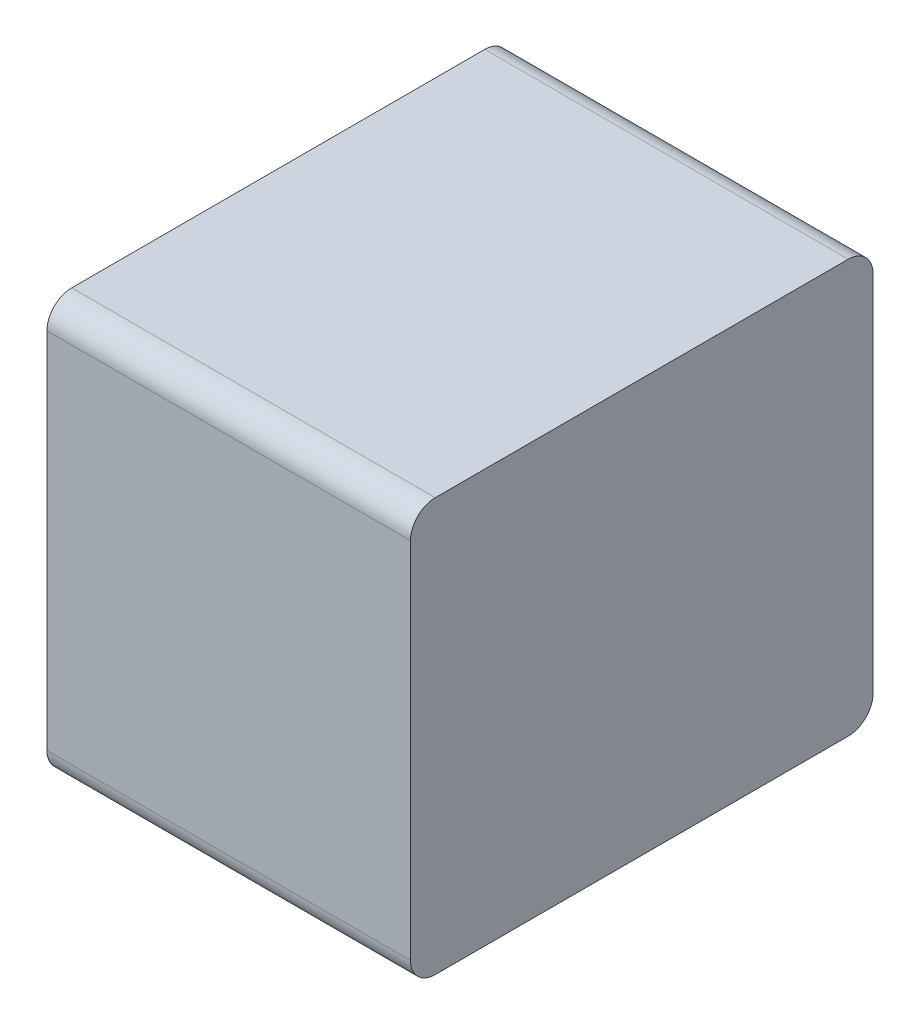
ISO-10303-21;
HEADER;
FILE_DESCRIPTION(('STEP AP214'),'2;1');
FILE_NAME('part.step','',(''),(''),'','','');
FILE_SCHEMA(('AUTOMOTIVE_DESIGN { 1 0 10303 214 1 1 1 1 }'));
ENDSEC;
DATA;
#1=APPLICATION_CONTEXT('core data for automotive mechanical design processes');
#2=APPLICATION_PROTOCOL_DEFINITION('international standard','automotive_design',2000,#1);
#3=PRODUCT_CONTEXT('',#1,'mechanical');
#4=PRODUCT('Part','Part','',(#3));
#5=PRODUCT_RELATED_PRODUCT_CATEGORY('part','',(#4));
#6=PRODUCT_DEFINITION_FORMATION('','',#4);
#7=PRODUCT_DEFINITION_CONTEXT('part definition',#1,'design');
#8=PRODUCT_DEFINITION('design','',#6,#7);
#9=PRODUCT_DEFINITION_SHAPE('','',#8);
#10=(LENGTH_UNIT() NAMED_UNIT(*) SI_UNIT(.MILLI.,.METRE.));
#11=(NAMED_UNIT(*) PLANE_ANGLE_UNIT() SI_UNIT($,.RADIAN.));
#12=(NAMED_UNIT(*) SI_UNIT($,.STERADIAN.) SOLID_ANGLE_UNIT());
#13=UNCERTAINTY_MEASURE_WITH_UNIT(LENGTH_MEASURE(1.E-05),#10,'distance_accuracy_value','');
#14=(GEOMETRIC_REPRESENTATION_CONTEXT(3) GLOBAL_UNCERTAINTY_ASSIGNED_CONTEXT((#13)) GLOBAL_UNIT_ASSIGNED_CONTEXT((#10,
#11,#12)) REPRESENTATION_CONTEXT('',''));
#15=CARTESIAN_POINT('',(0.,0.,0.));
#16=DIRECTION('',(0.,0.,1.));
#17=DIRECTION('',(1.,0.,0.));
#18=AXIS2_PLACEMENT_3D('',#15,#16,#17);
#19=CARTESIAN_POINT('',(0.55,1.1,0.15));
#20=DIRECTION('',(1.,0.,0.));
#21=DIRECTION('',(0.,0.707106781186547,-0.707106781186548));
#22=AXIS2_PLACEMENT_3D('',#19,#20,#21);
#23=CYLINDRICAL_SURFACE('',#22,0.15);
#24=CARTESIAN_POINT('',(1.1,1.1,0.15));
#25=DIRECTION('',(-1.,0.,0.));
#26=DIRECTION('',(0.,1.,0.));
#27=AXIS2_PLACEMENT_3D('',#24,#25,#26);
#28=CIRCLE('',#27,0.15);
#29=CARTESIAN_POINT('',(1.1,1.25,0.15));
#30=VERTEX_POINT('',#29);
#31=CARTESIAN_POINT('',(1.1,1.1,0.));
#32=VERTEX_POINT('',#31);
#33=EDGE_CURVE('E11',#30,#32,#28,.T.);
#34=ORIENTED_EDGE('',*,*,#33,.T.);
#35=DIRECTION('',(-1.,0.,0.));
#36=VECTOR('',#35,1.);
#37=CARTESIAN_POINT('',(1.1,1.1,0.));
#38=LINE('',#37,#36);
#39=CARTESIAN_POINT('',(-1.1,1.1,0.));
#40=VERTEX_POINT('',#39);
#41=EDGE_CURVE('E144',#32,#40,#38,.T.);
#42=ORIENTED_EDGE('',*,*,#41,.T.);
#43=CARTESIAN_POINT('',(-1.1,1.1,0.15));
#44=DIRECTION('',(1.,0.,0.));
#45=DIRECTION('',(0.,0.,-1.));
#46=AXIS2_PLACEMENT_3D('',#43,#44,#45);
#47=CIRCLE('',#46,0.15);
#48=CARTESIAN_POINT('',(-1.1,1.25,0.15));
#49=VERTEX_POINT('',#48);
#50=EDGE_CURVE('E142',#40,#49,#47,.T.);
#51=ORIENTED_EDGE('',*,*,#50,.T.);
#52=DIRECTION('',(1.,0.,0.));
#53=VECTOR('',#52,1.);
#54=CARTESIAN_POINT('',(-1.1,1.25,0.15));
#55=LINE('',#54,#53);
#56=EDGE_CURVE('E24',#49,#30,#55,.T.);
#57=ORIENTED_EDGE('',*,*,#56,.T.);
#58=EDGE_LOOP('',(#34,#42,#51,#57));
#59=FACE_BOUND('',#58,.T.);
#60=ADVANCED_FACE('F17',(#59),#23,.T.);
#61=CARTESIAN_POINT('',(1.1,1.25,0.));
#62=DIRECTION('',(0.,1.,0.));
#63=DIRECTION('',(-1.,0.,0.));
#64=AXIS2_PLACEMENT_3D('',#61,#62,#63);
#65=PLANE('',#64);
#66=ORIENTED_EDGE('',*,*,#56,.F.);
#67=DIRECTION('',(0.,0.,1.));
#68=VECTOR('',#67,1.);
#69=CARTESIAN_POINT('',(-1.1,1.25,0.15));
#70=LINE('',#69,#68);
#71=CARTESIAN_POINT('',(-1.1,1.25,2.65));
#72=VERTEX_POINT('',#71);
#73=EDGE_CURVE('E140',#49,#72,#70,.T.);
#74=ORIENTED_EDGE('',*,*,#73,.T.);
#75=DIRECTION('',(-1.,0.,0.));
#76=VECTOR('',#75,1.);
#77=CARTESIAN_POINT('',(1.1,1.25,2.65));
#78=LINE('',#77,#76);
#79=CARTESIAN_POINT('',(1.1,1.25,2.65));
#80=VERTEX_POINT('',#79);
#81=EDGE_CURVE('E132',#80,#72,#78,.T.);
#82=ORIENTED_EDGE('',*,*,#81,.F.);
#83=DIRECTION('',(0.,0.,1.));
#84=VECTOR('',#83,1.);
#85=CARTESIAN_POINT('',(1.1,1.25,0.15));
#86=LINE('',#85,#84);
#87=EDGE_CURVE('E125',#30,#80,#86,.T.);
#88=ORIENTED_EDGE('',*,*,#87,.F.);
#89=EDGE_LOOP('',(#66,#74,#82,#88));
#90=FACE_BOUND('',#89,.T.);
#91=ADVANCED_FACE('F147',(#90),#65,.T.);
#92=CARTESIAN_POINT('',(-1.1,1.25,0.));
#93=DIRECTION('',(-1.,0.,0.));
#94=DIRECTION('',(0.,-1.,0.));
#95=AXIS2_PLACEMENT_3D('',#92,#93,#94);
#96=PLANE('',#95);
#97=ORIENTED_EDGE('',*,*,#50,.F.);
#98=DIRECTION('',(0.,1.,0.));
#99=VECTOR('',#98,1.);
#100=CARTESIAN_POINT('',(-1.1,-1.1,0.));
#101=LINE('',#100,#99);
#102=CARTESIAN_POINT('',(-1.1,-1.1,0.));
#103=VERTEX_POINT('',#102);
#104=EDGE_CURVE('E135',#103,#40,#101,.T.);
#105=ORIENTED_EDGE('',*,*,#104,.F.);
#106=CARTESIAN_POINT('',(-1.1,-1.1,0.15));
#107=DIRECTION('',(1.,0.,0.));
#108=DIRECTION('',(0.,-1.,0.));
#109=AXIS2_PLACEMENT_3D('',#106,#107,#108);
#110=CIRCLE('',#109,0.15);
#111=CARTESIAN_POINT('',(-1.1,-1.25,0.15));
#112=VERTEX_POINT('',#111);
#113=EDGE_CURVE('E138',#112,#103,#110,.T.);
#114=ORIENTED_EDGE('',*,*,#113,.F.);
#115=DIRECTION('',(0.,0.,1.));
#116=VECTOR('',#115,1.);
#117=CARTESIAN_POINT('',(-1.1,-1.25,0.15));
#118=LINE('',#117,#116);
#119=CARTESIAN_POINT('',(-1.1,-1.25,2.65));
#120=VERTEX_POINT('',#119);
#121=EDGE_CURVE('E118',#112,#120,#118,.T.);
#122=ORIENTED_EDGE('',*,*,#121,.T.);
#123=CARTESIAN_POINT('',(-1.1,-1.1,2.65));
#124=DIRECTION('',(1.,0.,0.));
#125=DIRECTION('',(0.,0.,1.));
#126=AXIS2_PLACEMENT_3D('',#123,#124,#125);
#127=CIRCLE('',#126,0.15);
#128=CARTESIAN_POINT('',(-1.1,-1.1,2.8));
#129=VERTEX_POINT('',#128);
#130=EDGE_CURVE('E113',#129,#120,#127,.T.);
#131=ORIENTED_EDGE('',*,*,#130,.F.);
#132=DIRECTION('',(0.,-1.,0.));
#133=VECTOR('',#132,1.);
#134=CARTESIAN_POINT('',(-1.1,1.1,2.8));
#135=LINE('',#134,#133);
#136=CARTESIAN_POINT('',(-1.1,1.1,2.8));
#137=VERTEX_POINT('',#136);
#138=EDGE_CURVE('E89',#137,#129,#135,.T.);
#139=ORIENTED_EDGE('',*,*,#138,.F.);
#140=CARTESIAN_POINT('',(-1.1,1.1,2.65));
#141=DIRECTION('',(1.,0.,0.));
#142=DIRECTION('',(0.,1.,0.));
#143=AXIS2_PLACEMENT_3D('',#140,#141,#142);
#144=CIRCLE('',#143,0.15);
#145=EDGE_CURVE('E116',#72,#137,#144,.T.);
#146=ORIENTED_EDGE('',*,*,#145,.F.);
#147=ORIENTED_EDGE('',*,*,#73,.F.);
#148=EDGE_LOOP('',(#97,#105,#114,#122,#131,#139,#146,#147));
#149=FACE_BOUND('',#148,.T.);
#150=ADVANCED_FACE('F155',(#149),#96,.T.);
#151=CARTESIAN_POINT('',(-0.55,-1.1,0.15));
#152=DIRECTION('',(-1.,0.,0.));
#153=DIRECTION('',(0.,-0.707106781186548,-0.707106781186547));
#154=AXIS2_PLACEMENT_3D('',#151,#152,#153);
#155=CYLINDRICAL_SURFACE('',#154,0.15);
#156=ORIENTED_EDGE('',*,*,#113,.T.);
#157=DIRECTION('',(1.,0.,0.));
#158=VECTOR('',#157,1.);
#159=CARTESIAN_POINT('',(-1.1,-1.1,0.));
#160=LINE('',#159,#158);
#161=CARTESIAN_POINT('',(1.1,-1.1,0.));
#162=VERTEX_POINT('',#161);
#163=EDGE_CURVE('E127',#103,#162,#160,.T.);
#164=ORIENTED_EDGE('',*,*,#163,.T.);
#165=CARTESIAN_POINT('',(1.1,-1.1,0.15));
#166=DIRECTION('',(-1.,0.,0.));
#167=DIRECTION('',(0.,0.,-1.));
#168=AXIS2_PLACEMENT_3D('',#165,#166,#167);
#169=CIRCLE('',#168,0.15);
#170=CARTESIAN_POINT('',(1.1,-1.25,0.15));
#171=VERTEX_POINT('',#170);
#172=EDGE_CURVE('E120',#162,#171,#169,.T.);
#173=ORIENTED_EDGE('',*,*,#172,.T.);
#174=DIRECTION('',(-1.,0.,0.));
#175=VECTOR('',#174,1.);
#176=CARTESIAN_POINT('',(1.1,-1.25,0.15));
#177=LINE('',#176,#175);
#178=EDGE_CURVE('E129',#171,#112,#177,.T.);
#179=ORIENTED_EDGE('',*,*,#178,.T.);
#180=EDGE_LOOP('',(#156,#164,#173,#179));
#181=FACE_BOUND('',#180,.T.);
#182=ADVANCED_FACE('F177',(#181),#155,.T.);
#183=CARTESIAN_POINT('',(-1.1,-1.25,0.));
#184=DIRECTION('',(0.,-1.,0.));
#185=DIRECTION('',(1.,0.,0.));
#186=AXIS2_PLACEMENT_3D('',#183,#184,#185);
#187=PLANE('',#186);
#188=ORIENTED_EDGE('',*,*,#178,.F.);
#189=DIRECTION('',(0.,0.,1.));
#190=VECTOR('',#189,1.);
#191=CARTESIAN_POINT('',(1.1,-1.25,0.15));
#192=LINE('',#191,#190);
#193=CARTESIAN_POINT('',(1.1,-1.25,2.65));
#194=VERTEX_POINT('',#193);
#195=EDGE_CURVE('E123',#171,#194,#192,.T.);
#196=ORIENTED_EDGE('',*,*,#195,.T.);
#197=DIRECTION('',(1.,0.,0.));
#198=VECTOR('',#197,1.);
#199=CARTESIAN_POINT('',(-1.1,-1.25,2.65));
#200=LINE('',#199,#198);
#201=EDGE_CURVE('E86',#120,#194,#200,.T.);
#202=ORIENTED_EDGE('',*,*,#201,.F.);
#203=ORIENTED_EDGE('',*,*,#121,.F.);
#204=EDGE_LOOP('',(#188,#196,#202,#203));
#205=FACE_BOUND('',#204,.T.);
#206=ADVANCED_FACE('F167',(#205),#187,.T.);
#207=CARTESIAN_POINT('',(1.1,-1.25,0.));
#208=DIRECTION('',(1.,0.,0.));
#209=DIRECTION('',(0.,1.,0.));
#210=AXIS2_PLACEMENT_3D('',#207,#208,#209);
#211=PLANE('',#210);
#212=ORIENTED_EDGE('',*,*,#33,.F.);
#213=ORIENTED_EDGE('',*,*,#87,.T.);
#214=CARTESIAN_POINT('',(1.1,1.1,2.65));
#215=DIRECTION('',(-1.,0.,0.));
#216=DIRECTION('',(0.,0.,1.));
#217=AXIS2_PLACEMENT_3D('',#214,#215,#216);
#218=CIRCLE('',#217,0.15);
#219=CARTESIAN_POINT('',(1.1,1.1,2.8));
#220=VERTEX_POINT('',#219);
#221=EDGE_CURVE('E97',#220,#80,#218,.T.);
#222=ORIENTED_EDGE('',*,*,#221,.F.);
#223=DIRECTION('',(0.,1.,0.));
#224=VECTOR('',#223,1.);
#225=CARTESIAN_POINT('',(1.1,-1.1,2.8));
#226=LINE('',#225,#224);
#227=CARTESIAN_POINT('',(1.1,-1.1,2.8));
#228=VERTEX_POINT('',#227);
#229=EDGE_CURVE('E90',#228,#220,#226,.T.);
#230=ORIENTED_EDGE('',*,*,#229,.F.);
#231=CARTESIAN_POINT('',(1.1,-1.1,2.65));
#232=DIRECTION('',(-1.,0.,0.));
#233=DIRECTION('',(0.,-1.,0.));
#234=AXIS2_PLACEMENT_3D('',#231,#232,#233);
#235=CIRCLE('',#234,0.15);
#236=EDGE_CURVE('E79',#194,#228,#235,.T.);
#237=ORIENTED_EDGE('',*,*,#236,.F.);
#238=ORIENTED_EDGE('',*,*,#195,.F.);
#239=ORIENTED_EDGE('',*,*,#172,.F.);
#240=DIRECTION('',(0.,-1.,0.));
#241=VECTOR('',#240,1.);
#242=CARTESIAN_POINT('',(1.1,1.1,0.));
#243=LINE('',#242,#241);
#244=EDGE_CURVE('E104',#32,#162,#243,.T.);
#245=ORIENTED_EDGE('',*,*,#244,.F.);
#246=EDGE_LOOP('',(#212,#213,#222,#230,#237,#238,#239,#245));
#247=FACE_BOUND('',#246,.T.);
#248=ADVANCED_FACE('F94',(#247),#211,.T.);
#249=CARTESIAN_POINT('',(0.55,1.1,2.65));
#250=DIRECTION('',(-1.,0.,0.));
#251=DIRECTION('',(0.,0.707106781186547,0.707106781186548));
#252=AXIS2_PLACEMENT_3D('',#249,#250,#251);
#253=CYLINDRICAL_SURFACE('',#252,0.15);
#254=ORIENTED_EDGE('',*,*,#145,.T.);
#255=DIRECTION('',(1.,0.,0.));
#256=VECTOR('',#255,1.);
#257=CARTESIAN_POINT('',(-1.1,1.1,2.8));
#258=LINE('',#257,#256);
#259=EDGE_CURVE('E111',#137,#220,#258,.T.);
#260=ORIENTED_EDGE('',*,*,#259,.T.);
#261=ORIENTED_EDGE('',*,*,#221,.T.);
#262=ORIENTED_EDGE('',*,*,#81,.T.);
#263=EDGE_LOOP('',(#254,#260,#261,#262));
#264=FACE_BOUND('',#263,.T.);
#265=ADVANCED_FACE('F158',(#264),#253,.T.);
#266=CARTESIAN_POINT('',(0.,0.,2.8));
#267=DIRECTION('',(0.,0.,1.));
#268=DIRECTION('',(1.,0.,0.));
#269=AXIS2_PLACEMENT_3D('',#266,#267,#268);
#270=PLANE('',#269);
#271=ORIENTED_EDGE('',*,*,#259,.F.);
#272=ORIENTED_EDGE('',*,*,#138,.T.);
#273=DIRECTION('',(-1.,0.,0.));
#274=VECTOR('',#273,1.);
#275=CARTESIAN_POINT('',(1.1,-1.1,2.8));
#276=LINE('',#275,#274);
#277=EDGE_CURVE('E84',#228,#129,#276,.T.);
#278=ORIENTED_EDGE('',*,*,#277,.F.);
#279=ORIENTED_EDGE('',*,*,#229,.T.);
#280=EDGE_LOOP('',(#271,#272,#278,#279));
#281=FACE_BOUND('',#280,.T.);
#282=ADVANCED_FACE('F102',(#281),#270,.T.);
#283=CARTESIAN_POINT('',(-0.55,-1.1,2.65));
#284=DIRECTION('',(1.,0.,0.));
#285=DIRECTION('',(0.,-0.707106781186548,0.707106781186548));
#286=AXIS2_PLACEMENT_3D('',#283,#284,#285);
#287=CYLINDRICAL_SURFACE('',#286,0.15);
#288=ORIENTED_EDGE('',*,*,#236,.T.);
#289=ORIENTED_EDGE('',*,*,#277,.T.);
#290=ORIENTED_EDGE('',*,*,#130,.T.);
#291=ORIENTED_EDGE('',*,*,#201,.T.);
#292=EDGE_LOOP('',(#288,#289,#290,#291));
#293=FACE_BOUND('',#292,.T.);
#294=ADVANCED_FACE('F81',(#293),#287,.T.);
#295=CARTESIAN_POINT('',(0.,0.,0.));
#296=DIRECTION('',(0.,0.,1.));
#297=DIRECTION('',(1.,0.,0.));
#298=AXIS2_PLACEMENT_3D('',#295,#296,#297);
#299=PLANE('',#298);
#300=ORIENTED_EDGE('',*,*,#41,.F.);
#301=ORIENTED_EDGE('',*,*,#244,.T.);
#302=ORIENTED_EDGE('',*,*,#163,.F.);
#303=ORIENTED_EDGE('',*,*,#104,.T.);
#304=EDGE_LOOP('',(#300,#301,#302,#303));
#305=FACE_BOUND('',#304,.T.);
#306=ADVANCED_FACE('F152',(#305),#299,.F.);
#307=CLOSED_SHELL('',(#60,#91,#150,#182,#206,#248,#265,#282,#294,#306));
#308=MANIFOLD_SOLID_BREP('B1',#307);
#309=ADVANCED_BREP_SHAPE_REPRESENTATION('',(#18,#308),#14);
#310=SHAPE_DEFINITION_REPRESENTATION(#9,#309);
ENDSEC;
END-ISO-10303-21;
